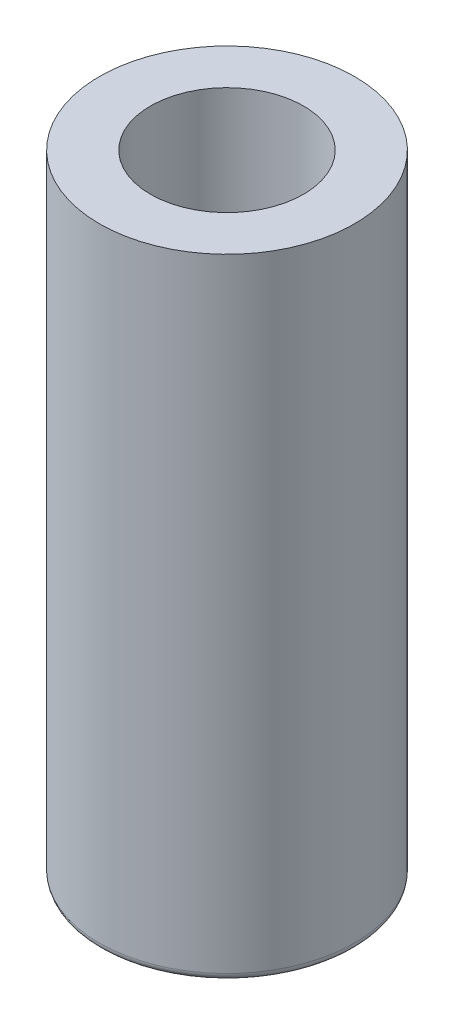
ISO-10303-21;
HEADER;
FILE_DESCRIPTION(('STEP AP214'),'2;1');
FILE_NAME('part.step','',(''),(''),'','','');
FILE_SCHEMA(('AUTOMOTIVE_DESIGN { 1 0 10303 214 1 1 1 1 }'));
ENDSEC;
DATA;
#1=APPLICATION_CONTEXT('core data for automotive mechanical design processes');
#2=APPLICATION_PROTOCOL_DEFINITION('international standard','automotive_design',2000,#1);
#3=PRODUCT_CONTEXT('',#1,'mechanical');
#4=PRODUCT('Part','Part','',(#3));
#5=PRODUCT_RELATED_PRODUCT_CATEGORY('part','',(#4));
#6=PRODUCT_DEFINITION_FORMATION('','',#4);
#7=PRODUCT_DEFINITION_CONTEXT('part definition',#1,'design');
#8=PRODUCT_DEFINITION('design','',#6,#7);
#9=PRODUCT_DEFINITION_SHAPE('','',#8);
#10=(LENGTH_UNIT() NAMED_UNIT(*) SI_UNIT(.MILLI.,.METRE.));
#11=(NAMED_UNIT(*) PLANE_ANGLE_UNIT() SI_UNIT($,.RADIAN.));
#12=(NAMED_UNIT(*) SI_UNIT($,.STERADIAN.) SOLID_ANGLE_UNIT());
#13=UNCERTAINTY_MEASURE_WITH_UNIT(LENGTH_MEASURE(1.E-05),#10,'distance_accuracy_value','');
#14=(GEOMETRIC_REPRESENTATION_CONTEXT(3) GLOBAL_UNCERTAINTY_ASSIGNED_CONTEXT((#13)) GLOBAL_UNIT_ASSIGNED_CONTEXT((#10,
#11,#12)) REPRESENTATION_CONTEXT('',''));
#15=CARTESIAN_POINT('',(0.,0.,0.));
#16=DIRECTION('',(0.,0.,1.));
#17=DIRECTION('',(1.,0.,0.));
#18=AXIS2_PLACEMENT_3D('',#15,#16,#17);
#19=CARTESIAN_POINT('',(0.,42.,0.));
#20=DIRECTION('',(0.,-1.,0.));
#21=DIRECTION('',(0.,0.,-1.));
#22=AXIS2_PLACEMENT_3D('',#19,#20,#21);
#23=CYLINDRICAL_SURFACE('',#22,8.5);
#24=CARTESIAN_POINT('',(0.,0.5,0.));
#25=DIRECTION('',(0.,1.,0.));
#26=DIRECTION('',(0.,0.,1.));
#27=AXIS2_PLACEMENT_3D('',#24,#25,#26);
#28=CIRCLE('',#27,8.5);
#29=CARTESIAN_POINT('',(0.,0.5,8.5));
#30=VERTEX_POINT('',#29);
#31=EDGE_CURVE('E53',#30,#30,#28,.T.);
#32=ORIENTED_EDGE('',*,*,#31,.T.);
#33=EDGE_LOOP('',(#32));
#34=FACE_BOUND('',#33,.T.);
#35=CARTESIAN_POINT('',(0.,42.,0.));
#36=DIRECTION('',(0.,1.,0.));
#37=DIRECTION('',(0.,0.,1.));
#38=AXIS2_PLACEMENT_3D('',#35,#36,#37);
#39=CIRCLE('',#38,8.5);
#40=CARTESIAN_POINT('',(0.,42.,8.5));
#41=VERTEX_POINT('',#40);
#42=EDGE_CURVE('E67',#41,#41,#39,.T.);
#43=ORIENTED_EDGE('',*,*,#42,.F.);
#44=EDGE_LOOP('',(#43));
#45=FACE_BOUND('',#44,.T.);
#46=ADVANCED_FACE('F45',(#34,#45),#23,.T.);
#47=CARTESIAN_POINT('',(0.,42.,0.));
#48=DIRECTION('',(0.,1.,0.));
#49=DIRECTION('',(0.,0.,1.));
#50=AXIS2_PLACEMENT_3D('',#47,#48,#49);
#51=PLANE('',#50);
#52=CARTESIAN_POINT('',(0.,42.,0.));
#53=DIRECTION('',(0.,1.,0.));
#54=DIRECTION('',(0.,0.,1.));
#55=AXIS2_PLACEMENT_3D('',#52,#53,#54);
#56=CIRCLE('',#55,5.1);
#57=CARTESIAN_POINT('',(0.,42.,5.1));
#58=VERTEX_POINT('',#57);
#59=EDGE_CURVE('E68',#58,#58,#56,.T.);
#60=ORIENTED_EDGE('',*,*,#59,.F.);
#61=EDGE_LOOP('',(#60));
#62=FACE_BOUND('',#61,.T.);
#63=ORIENTED_EDGE('',*,*,#42,.T.);
#64=EDGE_LOOP('',(#63));
#65=FACE_BOUND('',#64,.T.);
#66=ADVANCED_FACE('F90',(#62,#65),#51,.T.);
#67=CARTESIAN_POINT('',(0.,0.,0.));
#68=DIRECTION('',(0.,1.,0.));
#69=DIRECTION('',(0.,0.,1.));
#70=AXIS2_PLACEMENT_3D('',#67,#68,#69);
#71=PLANE('',#70);
#72=CARTESIAN_POINT('',(0.,0.,0.));
#73=DIRECTION('',(0.,1.,0.));
#74=DIRECTION('',(0.,0.,1.));
#75=AXIS2_PLACEMENT_3D('',#72,#73,#74);
#76=CIRCLE('',#75,8.);
#77=CARTESIAN_POINT('',(0.,0.,8.));
#78=VERTEX_POINT('',#77);
#79=EDGE_CURVE('E11',#78,#78,#76,.F.);
#80=ORIENTED_EDGE('',*,*,#79,.T.);
#81=EDGE_LOOP('',(#80));
#82=FACE_BOUND('',#81,.T.);
#83=ADVANCED_FACE('F60',(#82),#71,.F.);
#84=CARTESIAN_POINT('',(0.,15.,0.));
#85=DIRECTION('',(0.,1.,0.));
#86=DIRECTION('',(0.,0.,1.));
#87=AXIS2_PLACEMENT_3D('',#84,#85,#86);
#88=CONICAL_SURFACE('',#87,5.09999999999999,1.02974425867665);
#89=CARTESIAN_POINT('',(0.,11.9356108429594,0.));
#90=VERTEX_POINT('',#89);
#91=VERTEX_LOOP('',#90);
#92=FACE_BOUND('',#91,.T.);
#93=CARTESIAN_POINT('',(0.,15.,0.));
#94=DIRECTION('',(0.,1.,0.));
#95=DIRECTION('',(0.,0.,1.));
#96=AXIS2_PLACEMENT_3D('',#93,#94,#95);
#97=CIRCLE('',#96,5.09999999999999);
#98=CARTESIAN_POINT('',(0.,15.,5.09999999999999));
#99=VERTEX_POINT('',#98);
#100=EDGE_CURVE('E64',#99,#99,#97,.T.);
#101=ORIENTED_EDGE('',*,*,#100,.T.);
#102=EDGE_LOOP('',(#101));
#103=FACE_BOUND('',#102,.T.);
#104=ADVANCED_FACE('F56',(#92,#103),#88,.F.);
#105=CARTESIAN_POINT('',(0.,42.,0.));
#106=DIRECTION('',(0.,1.,0.));
#107=DIRECTION('',(0.,0.,1.));
#108=AXIS2_PLACEMENT_3D('',#105,#106,#107);
#109=CYLINDRICAL_SURFACE('',#108,5.09999999999999);
#110=ORIENTED_EDGE('',*,*,#100,.F.);
#111=EDGE_LOOP('',(#110));
#112=FACE_BOUND('',#111,.T.);
#113=ORIENTED_EDGE('',*,*,#59,.T.);
#114=EDGE_LOOP('',(#113));
#115=FACE_BOUND('',#114,.T.);
#116=ADVANCED_FACE('F59',(#112,#115),#109,.F.);
#117=CARTESIAN_POINT('',(0.,0.5,0.));
#118=DIRECTION('',(0.,1.,0.));
#119=DIRECTION('',(0.,0.,1.));
#120=AXIS2_PLACEMENT_3D('',#117,#118,#119);
#121=TOROIDAL_SURFACE('',#120,8.,0.5);
#122=ORIENTED_EDGE('',*,*,#79,.F.);
#123=EDGE_LOOP('',(#122));
#124=FACE_BOUND('',#123,.T.);
#125=ORIENTED_EDGE('',*,*,#31,.F.);
#126=EDGE_LOOP('',(#125));
#127=FACE_BOUND('',#126,.T.);
#128=ADVANCED_FACE('F47',(#124,#127),#121,.T.);
#129=CLOSED_SHELL('',(#46,#66,#83,#104,#116,#128));
#130=MANIFOLD_SOLID_BREP('B2',#129);
#131=ADVANCED_BREP_SHAPE_REPRESENTATION('',(#18,#130),#14);
#132=SHAPE_DEFINITION_REPRESENTATION(#9,#131);
ENDSEC;
END-ISO-10303-21;
